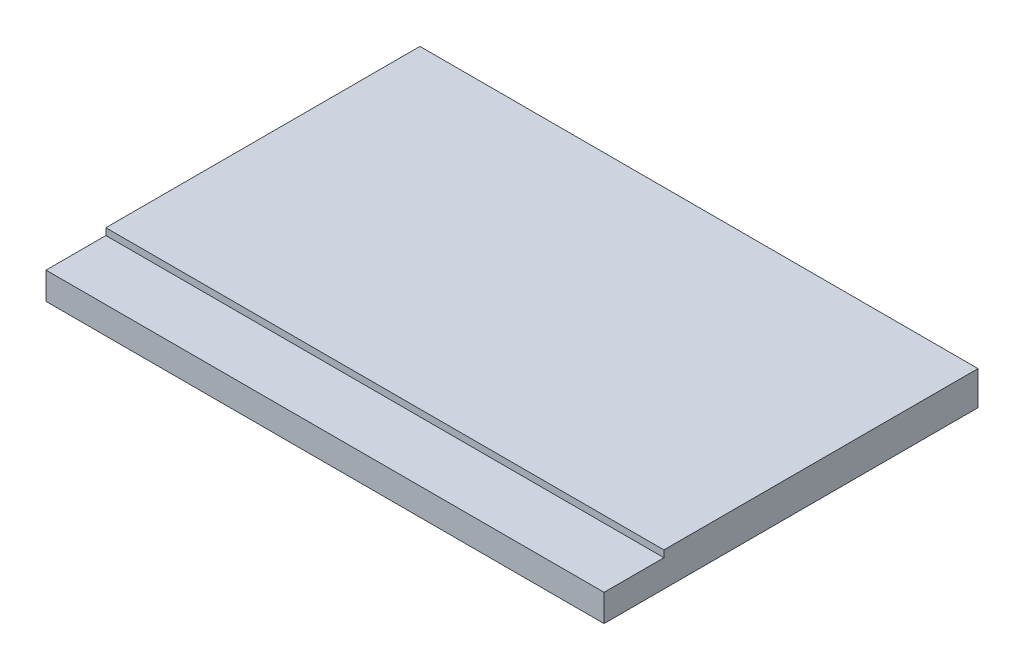
ISO-10303-21;
HEADER;
FILE_DESCRIPTION(('STEP AP214'),'2;1');
FILE_NAME('part.step','',(''),(''),'','','');
FILE_SCHEMA(('AUTOMOTIVE_DESIGN { 1 0 10303 214 1 1 1 1 }'));
ENDSEC;
DATA;
#1=APPLICATION_CONTEXT('core data for automotive mechanical design processes');
#2=APPLICATION_PROTOCOL_DEFINITION('international standard','automotive_design',2000,#1);
#3=PRODUCT_CONTEXT('',#1,'mechanical');
#4=PRODUCT('Part','Part','',(#3));
#5=PRODUCT_RELATED_PRODUCT_CATEGORY('part','',(#4));
#6=PRODUCT_DEFINITION_FORMATION('','',#4);
#7=PRODUCT_DEFINITION_CONTEXT('part definition',#1,'design');
#8=PRODUCT_DEFINITION('design','',#6,#7);
#9=PRODUCT_DEFINITION_SHAPE('','',#8);
#10=(LENGTH_UNIT() NAMED_UNIT(*) SI_UNIT(.MILLI.,.METRE.));
#11=(NAMED_UNIT(*) PLANE_ANGLE_UNIT() SI_UNIT($,.RADIAN.));
#12=(NAMED_UNIT(*) SI_UNIT($,.STERADIAN.) SOLID_ANGLE_UNIT());
#13=UNCERTAINTY_MEASURE_WITH_UNIT(LENGTH_MEASURE(1.E-05),#10,'distance_accuracy_value','');
#14=(GEOMETRIC_REPRESENTATION_CONTEXT(3) GLOBAL_UNCERTAINTY_ASSIGNED_CONTEXT((#13)) GLOBAL_UNIT_ASSIGNED_CONTEXT((#10,
#11,#12)) REPRESENTATION_CONTEXT('',''));
#15=CARTESIAN_POINT('',(0.,0.,0.));
#16=DIRECTION('',(0.,0.,1.));
#17=DIRECTION('',(1.,0.,0.));
#18=AXIS2_PLACEMENT_3D('',#15,#16,#17);
#19=CARTESIAN_POINT('',(12.35,1.5,8.275));
#20=DIRECTION('',(-1.,0.,0.));
#21=DIRECTION('',(0.,0.,1.));
#22=AXIS2_PLACEMENT_3D('',#19,#20,#21);
#23=PLANE('',#22);
#24=DIRECTION('',(0.,0.,-1.));
#25=VECTOR('',#24,1.);
#26=CARTESIAN_POINT('',(12.35,1.5,8.275));
#27=LINE('',#26,#25);
#28=CARTESIAN_POINT('',(12.35,1.5,5.625));
#29=VERTEX_POINT('',#28);
#30=CARTESIAN_POINT('',(12.35,1.5,-8.275));
#31=VERTEX_POINT('',#30);
#32=EDGE_CURVE('E100',#29,#31,#27,.T.);
#33=ORIENTED_EDGE('',*,*,#32,.F.);
#34=DIRECTION('',(0.,1.,0.));
#35=VECTOR('',#34,1.);
#36=CARTESIAN_POINT('',(12.35,1.2,5.625));
#37=LINE('',#36,#35);
#38=CARTESIAN_POINT('',(12.35,1.2,5.625));
#39=VERTEX_POINT('',#38);
#40=EDGE_CURVE('E50',#39,#29,#37,.T.);
#41=ORIENTED_EDGE('',*,*,#40,.F.);
#42=DIRECTION('',(0.,0.,-1.));
#43=VECTOR('',#42,1.);
#44=CARTESIAN_POINT('',(12.35,1.2,8.275));
#45=LINE('',#44,#43);
#46=CARTESIAN_POINT('',(12.35,1.2,8.275));
#47=VERTEX_POINT('',#46);
#48=EDGE_CURVE('E87',#47,#39,#45,.T.);
#49=ORIENTED_EDGE('',*,*,#48,.F.);
#50=DIRECTION('',(0.,-1.,0.));
#51=VECTOR('',#50,1.);
#52=CARTESIAN_POINT('',(12.35,1.5,8.275));
#53=LINE('',#52,#51);
#54=CARTESIAN_POINT('',(12.35,0.,8.275));
#55=VERTEX_POINT('',#54);
#56=EDGE_CURVE('E79',#47,#55,#53,.T.);
#57=ORIENTED_EDGE('',*,*,#56,.T.);
#58=DIRECTION('',(0.,0.,-1.));
#59=VECTOR('',#58,1.);
#60=CARTESIAN_POINT('',(12.35,0.,8.275));
#61=LINE('',#60,#59);
#62=CARTESIAN_POINT('',(12.35,0.,-8.275));
#63=VERTEX_POINT('',#62);
#64=EDGE_CURVE('E84',#55,#63,#61,.T.);
#65=ORIENTED_EDGE('',*,*,#64,.T.);
#66=DIRECTION('',(0.,-1.,0.));
#67=VECTOR('',#66,1.);
#68=CARTESIAN_POINT('',(12.35,1.5,-8.275));
#69=LINE('',#68,#67);
#70=EDGE_CURVE('E11',#31,#63,#69,.T.);
#71=ORIENTED_EDGE('',*,*,#70,.F.);
#72=EDGE_LOOP('',(#33,#41,#49,#57,#65,#71));
#73=FACE_BOUND('',#72,.T.);
#74=ADVANCED_FACE('F36',(#73),#23,.F.);
#75=CARTESIAN_POINT('',(-12.35,1.5,-8.275));
#76=DIRECTION('',(0.,0.,1.));
#77=DIRECTION('',(1.,0.,0.));
#78=AXIS2_PLACEMENT_3D('',#75,#76,#77);
#79=PLANE('',#78);
#80=DIRECTION('',(-1.,0.,0.));
#81=VECTOR('',#80,1.);
#82=CARTESIAN_POINT('',(-12.35,0.,-8.275));
#83=LINE('',#82,#81);
#84=CARTESIAN_POINT('',(-12.35,0.,-8.275));
#85=VERTEX_POINT('',#84);
#86=EDGE_CURVE('E104',#63,#85,#83,.T.);
#87=ORIENTED_EDGE('',*,*,#86,.T.);
#88=DIRECTION('',(0.,-1.,0.));
#89=VECTOR('',#88,1.);
#90=CARTESIAN_POINT('',(-12.35,1.5,-8.275));
#91=LINE('',#90,#89);
#92=CARTESIAN_POINT('',(-12.35,1.5,-8.275));
#93=VERTEX_POINT('',#92);
#94=EDGE_CURVE('E43',#93,#85,#91,.T.);
#95=ORIENTED_EDGE('',*,*,#94,.F.);
#96=DIRECTION('',(-1.,0.,0.));
#97=VECTOR('',#96,1.);
#98=CARTESIAN_POINT('',(-12.35,1.5,-8.275));
#99=LINE('',#98,#97);
#100=EDGE_CURVE('E59',#31,#93,#99,.T.);
#101=ORIENTED_EDGE('',*,*,#100,.F.);
#102=ORIENTED_EDGE('',*,*,#70,.T.);
#103=EDGE_LOOP('',(#87,#95,#101,#102));
#104=FACE_BOUND('',#103,.T.);
#105=ADVANCED_FACE('F120',(#104),#79,.F.);
#106=CARTESIAN_POINT('',(-12.35,1.5,8.275));
#107=DIRECTION('',(1.,0.,0.));
#108=DIRECTION('',(0.,0.,-1.));
#109=AXIS2_PLACEMENT_3D('',#106,#107,#108);
#110=PLANE('',#109);
#111=DIRECTION('',(0.,0.,1.));
#112=VECTOR('',#111,1.);
#113=CARTESIAN_POINT('',(-12.35,1.2,8.275));
#114=LINE('',#113,#112);
#115=CARTESIAN_POINT('',(-12.35,1.2,5.625));
#116=VERTEX_POINT('',#115);
#117=CARTESIAN_POINT('',(-12.35,1.2,8.275));
#118=VERTEX_POINT('',#117);
#119=EDGE_CURVE('E128',#116,#118,#114,.T.);
#120=ORIENTED_EDGE('',*,*,#119,.F.);
#121=DIRECTION('',(0.,1.,0.));
#122=VECTOR('',#121,1.);
#123=CARTESIAN_POINT('',(-12.35,1.2,5.625));
#124=LINE('',#123,#122);
#125=CARTESIAN_POINT('',(-12.35,1.5,5.625));
#126=VERTEX_POINT('',#125);
#127=EDGE_CURVE('E105',#116,#126,#124,.T.);
#128=ORIENTED_EDGE('',*,*,#127,.T.);
#129=DIRECTION('',(0.,0.,1.));
#130=VECTOR('',#129,1.);
#131=CARTESIAN_POINT('',(-12.35,1.5,8.275));
#132=LINE('',#131,#130);
#133=EDGE_CURVE('E91',#93,#126,#132,.T.);
#134=ORIENTED_EDGE('',*,*,#133,.F.);
#135=ORIENTED_EDGE('',*,*,#94,.T.);
#136=DIRECTION('',(0.,0.,1.));
#137=VECTOR('',#136,1.);
#138=CARTESIAN_POINT('',(-12.35,0.,8.275));
#139=LINE('',#138,#137);
#140=CARTESIAN_POINT('',(-12.35,0.,8.275));
#141=VERTEX_POINT('',#140);
#142=EDGE_CURVE('E101',#85,#141,#139,.T.);
#143=ORIENTED_EDGE('',*,*,#142,.T.);
#144=DIRECTION('',(0.,-1.,0.));
#145=VECTOR('',#144,1.);
#146=CARTESIAN_POINT('',(-12.35,1.5,8.275));
#147=LINE('',#146,#145);
#148=EDGE_CURVE('E90',#118,#141,#147,.T.);
#149=ORIENTED_EDGE('',*,*,#148,.F.);
#150=EDGE_LOOP('',(#120,#128,#134,#135,#143,#149));
#151=FACE_BOUND('',#150,.T.);
#152=ADVANCED_FACE('F118',(#151),#110,.F.);
#153=CARTESIAN_POINT('',(-12.35,1.5,8.275));
#154=DIRECTION('',(0.,0.,-1.));
#155=DIRECTION('',(-1.,0.,0.));
#156=AXIS2_PLACEMENT_3D('',#153,#154,#155);
#157=PLANE('',#156);
#158=ORIENTED_EDGE('',*,*,#56,.F.);
#159=DIRECTION('',(1.,0.,0.));
#160=VECTOR('',#159,1.);
#161=CARTESIAN_POINT('',(-12.35,1.2,8.275));
#162=LINE('',#161,#160);
#163=EDGE_CURVE('E132',#118,#47,#162,.T.);
#164=ORIENTED_EDGE('',*,*,#163,.F.);
#165=ORIENTED_EDGE('',*,*,#148,.T.);
#166=DIRECTION('',(1.,0.,0.));
#167=VECTOR('',#166,1.);
#168=CARTESIAN_POINT('',(-12.35,0.,8.275));
#169=LINE('',#168,#167);
#170=EDGE_CURVE('E94',#141,#55,#169,.T.);
#171=ORIENTED_EDGE('',*,*,#170,.T.);
#172=EDGE_LOOP('',(#158,#164,#165,#171));
#173=FACE_BOUND('',#172,.T.);
#174=ADVANCED_FACE('F95',(#173),#157,.F.);
#175=CARTESIAN_POINT('',(0.,1.5,0.));
#176=DIRECTION('',(0.,-1.,0.));
#177=DIRECTION('',(0.,0.,-1.));
#178=AXIS2_PLACEMENT_3D('',#175,#176,#177);
#179=PLANE('',#178);
#180=ORIENTED_EDGE('',*,*,#133,.T.);
#181=DIRECTION('',(-1.,0.,0.));
#182=VECTOR('',#181,1.);
#183=CARTESIAN_POINT('',(-12.35,1.5,5.625));
#184=LINE('',#183,#182);
#185=EDGE_CURVE('E126',#29,#126,#184,.T.);
#186=ORIENTED_EDGE('',*,*,#185,.F.);
#187=ORIENTED_EDGE('',*,*,#32,.T.);
#188=ORIENTED_EDGE('',*,*,#100,.T.);
#189=EDGE_LOOP('',(#180,#186,#187,#188));
#190=FACE_BOUND('',#189,.T.);
#191=ADVANCED_FACE('F146',(#190),#179,.F.);
#192=CARTESIAN_POINT('',(0.,0.,0.));
#193=DIRECTION('',(0.,-1.,0.));
#194=DIRECTION('',(0.,0.,-1.));
#195=AXIS2_PLACEMENT_3D('',#192,#193,#194);
#196=PLANE('',#195);
#197=ORIENTED_EDGE('',*,*,#64,.F.);
#198=ORIENTED_EDGE('',*,*,#170,.F.);
#199=ORIENTED_EDGE('',*,*,#142,.F.);
#200=ORIENTED_EDGE('',*,*,#86,.F.);
#201=EDGE_LOOP('',(#197,#198,#199,#200));
#202=FACE_BOUND('',#201,.T.);
#203=ADVANCED_FACE('F103',(#202),#196,.T.);
#204=CARTESIAN_POINT('',(-12.35,1.2,5.625));
#205=DIRECTION('',(0.,0.,-1.));
#206=DIRECTION('',(-1.,0.,0.));
#207=AXIS2_PLACEMENT_3D('',#204,#205,#206);
#208=PLANE('',#207);
#209=ORIENTED_EDGE('',*,*,#185,.T.);
#210=ORIENTED_EDGE('',*,*,#127,.F.);
#211=DIRECTION('',(-1.,0.,0.));
#212=VECTOR('',#211,1.);
#213=CARTESIAN_POINT('',(-12.35,1.2,5.625));
#214=LINE('',#213,#212);
#215=EDGE_CURVE('E124',#39,#116,#214,.T.);
#216=ORIENTED_EDGE('',*,*,#215,.F.);
#217=ORIENTED_EDGE('',*,*,#40,.T.);
#218=EDGE_LOOP('',(#209,#210,#216,#217));
#219=FACE_BOUND('',#218,.T.);
#220=ADVANCED_FACE('F145',(#219),#208,.F.);
#221=CARTESIAN_POINT('',(0.,1.2,0.));
#222=DIRECTION('',(0.,-1.,0.));
#223=DIRECTION('',(0.,0.,-1.));
#224=AXIS2_PLACEMENT_3D('',#221,#222,#223);
#225=PLANE('',#224);
#226=ORIENTED_EDGE('',*,*,#119,.T.);
#227=ORIENTED_EDGE('',*,*,#163,.T.);
#228=ORIENTED_EDGE('',*,*,#48,.T.);
#229=ORIENTED_EDGE('',*,*,#215,.T.);
#230=EDGE_LOOP('',(#226,#227,#228,#229));
#231=FACE_BOUND('',#230,.T.);
#232=ADVANCED_FACE('F138',(#231),#225,.F.);
#233=CLOSED_SHELL('',(#74,#105,#152,#174,#191,#203,#220,#232));
#234=MANIFOLD_SOLID_BREP('B2',#233);
#235=ADVANCED_BREP_SHAPE_REPRESENTATION('',(#18,#234),#14);
#236=SHAPE_DEFINITION_REPRESENTATION(#9,#235);
ENDSEC;
END-ISO-10303-21;
